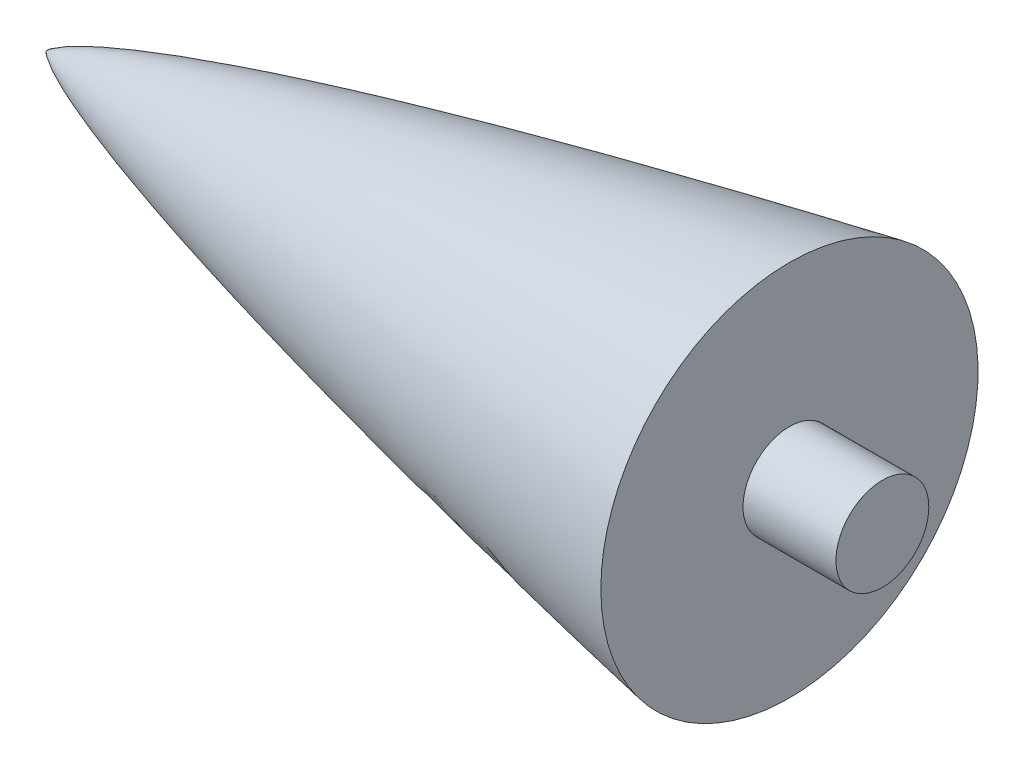
ISO-10303-21;
HEADER;
FILE_DESCRIPTION(('STEP AP214'),'2;1');
FILE_NAME('part.step','',(''),(''),'','','');
FILE_SCHEMA(('AUTOMOTIVE_DESIGN { 1 0 10303 214 1 1 1 1 }'));
ENDSEC;
DATA;
#1=APPLICATION_CONTEXT('core data for automotive mechanical design processes');
#2=APPLICATION_PROTOCOL_DEFINITION('international standard','automotive_design',2000,#1);
#3=PRODUCT_CONTEXT('',#1,'mechanical');
#4=PRODUCT('Part','Part','',(#3));
#5=PRODUCT_RELATED_PRODUCT_CATEGORY('part','',(#4));
#6=PRODUCT_DEFINITION_FORMATION('','',#4);
#7=PRODUCT_DEFINITION_CONTEXT('part definition',#1,'design');
#8=PRODUCT_DEFINITION('design','',#6,#7);
#9=PRODUCT_DEFINITION_SHAPE('','',#8);
#10=(LENGTH_UNIT() NAMED_UNIT(*) SI_UNIT(.MILLI.,.METRE.));
#11=(NAMED_UNIT(*) PLANE_ANGLE_UNIT() SI_UNIT($,.RADIAN.));
#12=(NAMED_UNIT(*) SI_UNIT($,.STERADIAN.) SOLID_ANGLE_UNIT());
#13=UNCERTAINTY_MEASURE_WITH_UNIT(LENGTH_MEASURE(1.E-05),#10,'distance_accuracy_value','');
#14=(GEOMETRIC_REPRESENTATION_CONTEXT(3) GLOBAL_UNCERTAINTY_ASSIGNED_CONTEXT((#13)) GLOBAL_UNIT_ASSIGNED_CONTEXT((#10,
#11,#12)) REPRESENTATION_CONTEXT('',''));
#15=CARTESIAN_POINT('',(0.,0.,0.));
#16=DIRECTION('',(0.,0.,1.));
#17=DIRECTION('',(1.,0.,0.));
#18=AXIS2_PLACEMENT_3D('',#15,#16,#17);
#19=CARTESIAN_POINT('',(0.,0.,0.));
#20=CARTESIAN_POINT('',(0.00238035997467733,0.0076011360778813,0.));
#21=CARTESIAN_POINT('',(0.00798466837960896,0.0223856697222698,0.));
#22=CARTESIAN_POINT('',(0.0228401150590813,0.0501833866003635,0.));
#23=CARTESIAN_POINT('',(0.0602326607252037,0.101267556911976,0.));
#24=CARTESIAN_POINT('',(0.117712206300395,0.166235145023001,0.));
#25=CARTESIAN_POINT('',(0.19726092234631,0.242935889185385,0.));
#26=CARTESIAN_POINT('',(0.316636954176446,0.345966558933334,0.));
#27=CARTESIAN_POINT('',(0.466313208156419,0.461855796292357,0.));
#28=CARTESIAN_POINT('',(0.64110457480571,0.585434487024376,0.));
#29=CARTESIAN_POINT('',(0.840927563647119,0.716336462312511,0.));
#30=CARTESIAN_POINT('',(1.08630400061248,0.868078740313604,0.));
#31=CARTESIAN_POINT('',(1.3805140783841,1.03915253918921,0.));
#32=CARTESIAN_POINT('',(1.73039943049731,1.23059941861425,0.));
#33=CARTESIAN_POINT('',(2.10392059668018,1.42354959389184,0.));
#34=CARTESIAN_POINT('',(2.44951561837744,1.59464165691464,0.));
#35=CARTESIAN_POINT('',(2.8342582543806,1.77902728884111,0.));
#36=CARTESIAN_POINT('',(3.32523532989474,2.00639453517896,0.));
#37=CARTESIAN_POINT('',(3.95823736587216,2.28701277693298,0.));
#38=CARTESIAN_POINT('',(5.24838346585034,2.83197588814661,0.));
#39=CARTESIAN_POINT('',(7.70022289015023,3.7871285095325,0.));
#40=CARTESIAN_POINT('',(12.4183987756164,5.43489889232549,0.));
#41=CARTESIAN_POINT('',(21.4878668486138,8.20445693610999,0.));
#42=CARTESIAN_POINT('',(34.2023586445507,11.5665873148162,0.));
#43=CARTESIAN_POINT('',(49.9837066694842,15.3040734435677,0.));
#44=CARTESIAN_POINT('',(77.2137650809594,21.1912043077746,0.));
#45=CARTESIAN_POINT('',(111.509421775575,27.7892992188203,0.));
#46=CARTESIAN_POINT('',(153.127410240743,35.0456177134566,0.));
#47=CARTESIAN_POINT('',(202.079624895492,42.8365860425714,0.));
#48=CARTESIAN_POINT('',(248.676771970826,49.7601957810546,0.));
#49=CARTESIAN_POINT('',(306.994191139808,57.9227193178528,0.));
#50=CARTESIAN_POINT('',(377.064507832727,67.0587719531232,0.));
#51=CARTESIAN_POINT('',(458.911254582009,76.93757318835,0.));
#52=CARTESIAN_POINT('',(552.552386087888,87.3435956773155,0.));
#53=CARTESIAN_POINT('',(646.27586099522,96.9776309007265,0.));
#54=CARTESIAN_POINT('',(740.068728044023,105.909330238405,0.));
#55=CARTESIAN_POINT('',(833.922122588579,114.180058458328,0.));
#56=CARTESIAN_POINT('',(927.829746144443,121.810111121398,0.));
#57=CARTESIAN_POINT('',(1021.7871091398,128.801272239229,0.));
#58=CARTESIAN_POINT('',(1115.79102912492,135.136696370842,0.));
#59=CARTESIAN_POINT('',(1198.0833333225,140.071466306922,0.));
#60=CARTESIAN_POINT('',(1268.64659039088,143.821063480985,0.));
#61=CARTESIAN_POINT('',(1327.46719210481,146.584126696369,0.));
#62=CARTESIAN_POINT('',(1374.5344213245,148.553508869585,0.));
#63=CARTESIAN_POINT('',(1414.76845078515,150.000622863617,0.));
#64=CARTESIAN_POINT('',(1448.16473396307,151.010913327166,0.));
#65=CARTESIAN_POINT('',(1474.7195583583,151.671460190239,0.));
#66=CARTESIAN_POINT('',(1491.96624087526,152.024358370583,0.));
#67=CARTESIAN_POINT('',(1506.75036650976,152.25898736052,0.));
#68=CARTESIAN_POINT('',(1516.60712853408,152.362707824974,0.));
#69=CARTESIAN_POINT('',(1521.53568050317,152.395628722459,0.));
#70=CARTESIAN_POINT('',(1524.,152.4,0.));
#71=B_SPLINE_CURVE_WITH_KNOTS('',4,(#19,#20,#21,#22,#23,#24,#25,#26,#27,#28,#29,#30,#31,#32,#33,
#34,#35,#36,#37,#38,#39,#40,#41,#42,#43,#44,#45,#46,#47,#48,#49,#50,#51,#52,#53,#54,#55,#56,#57,
#58,#59,#60,#61,#62,#63,#64,#65,#66,#67,#68,#69,#70),.UNSPECIFIED.,.F.,.F.,(5,1,1,1,1,1,1,1,1,1,
1,1,1,1,1,1,1,1,1,1,1,1,1,1,1,1,1,1,1,1,1,1,1,1,1,1,1,1,1,1,1,1,1,1,1,1,1,1,5),(0.,
2.05516393991926E-05,4.11032787983851E-05,8.22065575967702E-05,0.00016441311519354,
0.000246619672790311,0.000328826230387081,0.000493239345580621,0.000657652460774162,
0.000804573036816619,0.000951493612859076,0.00124533476494399,0.00154479174871456,
0.00184424873248513,0.00204745084835765,0.00225065296423016,0.0026570571959752,
0.00325478883200249,0.00385252046802978,0.00590167698954032,0.00951586252134176,
0.0162807635228404,0.0285690036013012,0.0401814036866866,0.051793803772072,0.0889073662699187,
0.11961078556872,0.15031420486752,0.181017621368193,0.211721037868866,0.27312787179488,
0.334534706421201,0.395941541348576,0.457348376315497,0.518755211151348,0.580162045729085,
0.641568880581471,0.702975716282408,0.764382551413628,0.825789385852659,0.85649280369749,
0.887196221542322,0.917899639147717,0.948603056753113,0.961452292564834,0.974301528376556,
0.987150764188278,0.993575382094139,1.),.UNSPECIFIED.);
#72=CARTESIAN_POINT('',(183.101312307485,0.,0.));
#73=DIRECTION('',(-1.,0.,0.));
#74=AXIS1_PLACEMENT('',#72,#73);
#75=SURFACE_OF_REVOLUTION('',#71,#74);
#76=CARTESIAN_POINT('',(101.6,0.,0.));
#77=DIRECTION('',(-1.,0.,0.));
#78=DIRECTION('',(0.,0.,1.));
#79=AXIS2_PLACEMENT_3D('',#76,#77,#78);
#80=CIRCLE('',#79,25.7872300095119);
#81=CARTESIAN_POINT('',(101.6,0.,25.7872300095119));
#82=VERTEX_POINT('',#81);
#83=EDGE_CURVE('E39',#82,#82,#80,.T.);
#84=ORIENTED_EDGE('',*,*,#83,.T.);
#85=EDGE_LOOP('',(#84));
#86=FACE_BOUND('',#85,.T.);
#87=CARTESIAN_POINT('',(0.,0.,0.));
#88=VERTEX_POINT('',#87);
#89=VERTEX_LOOP('',#88);
#90=FACE_BOUND('',#89,.T.);
#91=ADVANCED_FACE('F35',(#86,#90),#75,.F.);
#92=CARTESIAN_POINT('',(101.6,-1.0935515297718E-13,0.));
#93=DIRECTION('',(-1.,0.,0.));
#94=DIRECTION('',(0.,0.,1.));
#95=AXIS2_PLACEMENT_3D('',#92,#93,#94);
#96=PLANE('',#95);
#97=CARTESIAN_POINT('',(101.6,0.,0.));
#98=DIRECTION('',(1.,0.,0.));
#99=DIRECTION('',(0.,0.,-1.));
#100=AXIS2_PLACEMENT_3D('',#97,#98,#99);
#101=CIRCLE('',#100,6.35);
#102=CARTESIAN_POINT('',(101.6,0.,-6.35));
#103=VERTEX_POINT('',#102);
#104=EDGE_CURVE('E11',#103,#103,#101,.T.);
#105=ORIENTED_EDGE('',*,*,#104,.F.);
#106=EDGE_LOOP('',(#105));
#107=FACE_BOUND('',#106,.T.);
#108=ORIENTED_EDGE('',*,*,#83,.F.);
#109=EDGE_LOOP('',(#108));
#110=FACE_BOUND('',#109,.T.);
#111=ADVANCED_FACE('F46',(#107,#110),#96,.F.);
#112=CARTESIAN_POINT('',(114.3,0.,0.));
#113=DIRECTION('',(-1.,0.,0.));
#114=DIRECTION('',(0.,0.,1.));
#115=AXIS2_PLACEMENT_3D('',#112,#113,#114);
#116=CYLINDRICAL_SURFACE('',#115,6.35);
#117=CARTESIAN_POINT('',(114.3,0.,0.));
#118=DIRECTION('',(1.,0.,0.));
#119=DIRECTION('',(0.,0.,-1.));
#120=AXIS2_PLACEMENT_3D('',#117,#118,#119);
#121=CIRCLE('',#120,6.35);
#122=CARTESIAN_POINT('',(114.3,0.,-6.35));
#123=VERTEX_POINT('',#122);
#124=EDGE_CURVE('E56',#123,#123,#121,.T.);
#125=ORIENTED_EDGE('',*,*,#124,.F.);
#126=EDGE_LOOP('',(#125));
#127=FACE_BOUND('',#126,.T.);
#128=ORIENTED_EDGE('',*,*,#104,.T.);
#129=EDGE_LOOP('',(#128));
#130=FACE_BOUND('',#129,.T.);
#131=ADVANCED_FACE('F51',(#127,#130),#116,.T.);
#132=CARTESIAN_POINT('',(114.3,0.,0.));
#133=DIRECTION('',(1.,0.,0.));
#134=DIRECTION('',(0.,0.,-1.));
#135=AXIS2_PLACEMENT_3D('',#132,#133,#134);
#136=PLANE('',#135);
#137=ORIENTED_EDGE('',*,*,#124,.T.);
#138=EDGE_LOOP('',(#137));
#139=FACE_BOUND('',#138,.T.);
#140=ADVANCED_FACE('F67',(#139),#136,.T.);
#141=CLOSED_SHELL('',(#91,#111,#131,#140));
#142=MANIFOLD_SOLID_BREP('B2',#141);
#143=ADVANCED_BREP_SHAPE_REPRESENTATION('',(#18,#142),#14);
#144=SHAPE_DEFINITION_REPRESENTATION(#9,#143);
ENDSEC;
END-ISO-10303-21;
